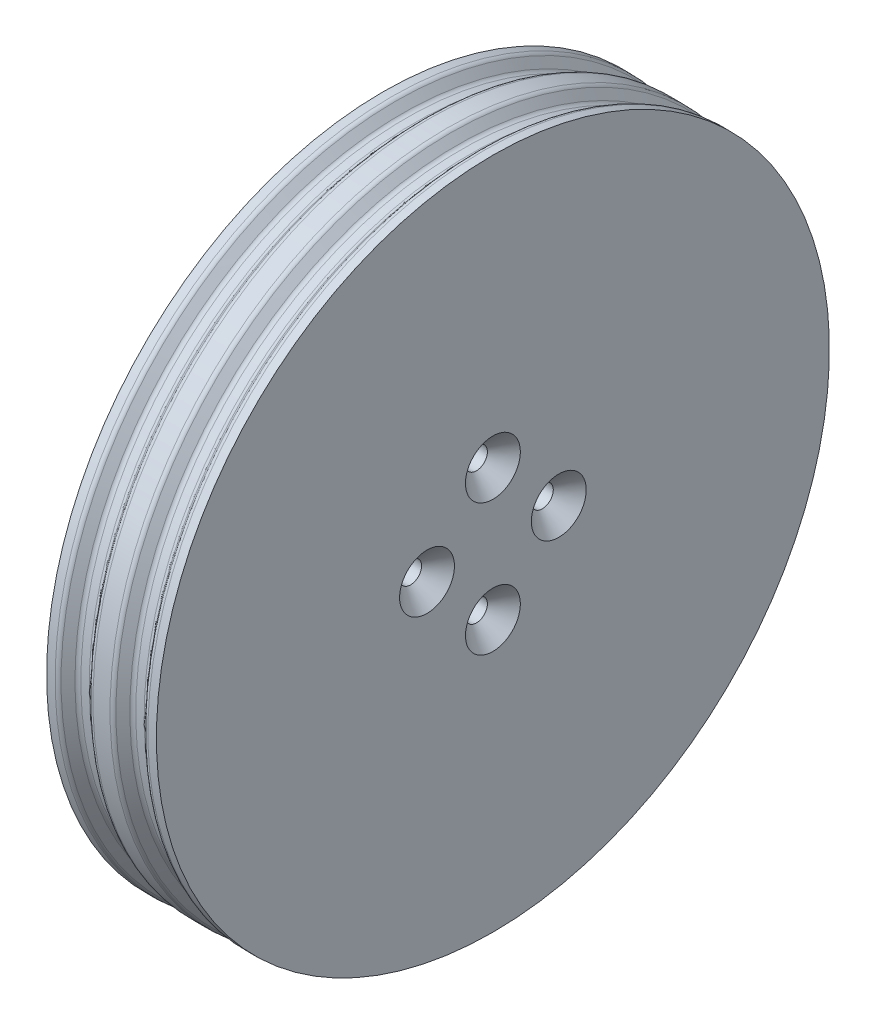
ISO-10303-21;
HEADER;
FILE_DESCRIPTION(('STEP AP214'),'2;1');
FILE_NAME('part.step','',(''),(''),'','','');
FILE_SCHEMA(('AUTOMOTIVE_DESIGN { 1 0 10303 214 1 1 1 1 }'));
ENDSEC;
DATA;
#1=APPLICATION_CONTEXT('core data for automotive mechanical design processes');
#2=APPLICATION_PROTOCOL_DEFINITION('international standard','automotive_design',2000,#1);
#3=PRODUCT_CONTEXT('',#1,'mechanical');
#4=PRODUCT('Part','Part','',(#3));
#5=PRODUCT_RELATED_PRODUCT_CATEGORY('part','',(#4));
#6=PRODUCT_DEFINITION_FORMATION('','',#4);
#7=PRODUCT_DEFINITION_CONTEXT('part definition',#1,'design');
#8=PRODUCT_DEFINITION('design','',#6,#7);
#9=PRODUCT_DEFINITION_SHAPE('','',#8);
#10=(LENGTH_UNIT() NAMED_UNIT(*) SI_UNIT(.MILLI.,.METRE.));
#11=(NAMED_UNIT(*) PLANE_ANGLE_UNIT() SI_UNIT($,.RADIAN.));
#12=(NAMED_UNIT(*) SI_UNIT($,.STERADIAN.) SOLID_ANGLE_UNIT());
#13=UNCERTAINTY_MEASURE_WITH_UNIT(LENGTH_MEASURE(1.E-05),#10,'distance_accuracy_value','');
#14=(GEOMETRIC_REPRESENTATION_CONTEXT(3) GLOBAL_UNCERTAINTY_ASSIGNED_CONTEXT((#13)) GLOBAL_UNIT_ASSIGNED_CONTEXT((#10,
#11,#12)) REPRESENTATION_CONTEXT('',''));
#15=CARTESIAN_POINT('',(0.,0.,0.));
#16=DIRECTION('',(0.,0.,1.));
#17=DIRECTION('',(1.,0.,0.));
#18=AXIS2_PLACEMENT_3D('',#15,#16,#17);
#19=CARTESIAN_POINT('',(0.,0.,0.));
#20=DIRECTION('',(1.,0.,0.));
#21=DIRECTION('',(0.,1.,0.));
#22=AXIS2_PLACEMENT_3D('',#19,#20,#21);
#23=PLANE('',#22);
#24=CARTESIAN_POINT('',(0.,6.,0.));
#25=DIRECTION('',(1.,0.,0.));
#26=DIRECTION('',(0.,1.,0.));
#27=AXIS2_PLACEMENT_3D('',#24,#25,#26);
#28=CIRCLE('',#27,1.);
#29=CARTESIAN_POINT('',(0.,7.,0.));
#30=VERTEX_POINT('',#29);
#31=EDGE_CURVE('E129',#30,#30,#28,.T.);
#32=ORIENTED_EDGE('',*,*,#31,.T.);
#33=EDGE_LOOP('',(#32));
#34=FACE_BOUND('',#33,.T.);
#35=CARTESIAN_POINT('',(0.,0.,-6.));
#36=DIRECTION('',(1.,0.,0.));
#37=DIRECTION('',(0.,1.,0.));
#38=AXIS2_PLACEMENT_3D('',#35,#36,#37);
#39=CIRCLE('',#38,0.999999999999999);
#40=CARTESIAN_POINT('',(0.,1.,-6.));
#41=VERTEX_POINT('',#40);
#42=EDGE_CURVE('E132',#41,#41,#39,.T.);
#43=ORIENTED_EDGE('',*,*,#42,.T.);
#44=EDGE_LOOP('',(#43));
#45=FACE_BOUND('',#44,.T.);
#46=CARTESIAN_POINT('',(0.,-6.,0.));
#47=DIRECTION('',(1.,0.,0.));
#48=DIRECTION('',(0.,1.,0.));
#49=AXIS2_PLACEMENT_3D('',#46,#47,#48);
#50=CIRCLE('',#49,1.);
#51=CARTESIAN_POINT('',(0.,-5.,0.));
#52=VERTEX_POINT('',#51);
#53=EDGE_CURVE('E135',#52,#52,#50,.T.);
#54=ORIENTED_EDGE('',*,*,#53,.T.);
#55=EDGE_LOOP('',(#54));
#56=FACE_BOUND('',#55,.T.);
#57=CARTESIAN_POINT('',(0.,0.,6.));
#58=DIRECTION('',(1.,0.,0.));
#59=DIRECTION('',(0.,1.,0.));
#60=AXIS2_PLACEMENT_3D('',#57,#58,#59);
#61=CIRCLE('',#60,1.);
#62=CARTESIAN_POINT('',(0.,1.,6.));
#63=VERTEX_POINT('',#62);
#64=EDGE_CURVE('E138',#63,#63,#61,.T.);
#65=ORIENTED_EDGE('',*,*,#64,.T.);
#66=EDGE_LOOP('',(#65));
#67=FACE_BOUND('',#66,.T.);
#68=CARTESIAN_POINT('',(0.,0.,0.));
#69=DIRECTION('',(-1.,0.,0.));
#70=DIRECTION('',(0.,-1.,0.));
#71=AXIS2_PLACEMENT_3D('',#68,#69,#70);
#72=CIRCLE('',#71,17.3);
#73=CARTESIAN_POINT('',(0.,-17.3,0.));
#74=VERTEX_POINT('',#73);
#75=EDGE_CURVE('E117',#74,#74,#72,.T.);
#76=ORIENTED_EDGE('',*,*,#75,.T.);
#77=EDGE_LOOP('',(#76));
#78=FACE_BOUND('',#77,.T.);
#79=ADVANCED_FACE('F37',(#34,#45,#56,#67,#78),#23,.F.);
#80=CARTESIAN_POINT('',(0.,0.,0.));
#81=DIRECTION('',(-1.,0.,0.));
#82=DIRECTION('',(0.,-1.,0.));
#83=AXIS2_PLACEMENT_3D('',#80,#81,#82);
#84=CYLINDRICAL_SURFACE('',#83,17.3);
#85=ORIENTED_EDGE('',*,*,#75,.F.);
#86=EDGE_LOOP('',(#85));
#87=FACE_BOUND('',#86,.T.);
#88=CARTESIAN_POINT('',(-7.,0.,0.));
#89=DIRECTION('',(-1.,0.,0.));
#90=DIRECTION('',(0.,-1.,0.));
#91=AXIS2_PLACEMENT_3D('',#88,#89,#90);
#92=CIRCLE('',#91,17.3);
#93=CARTESIAN_POINT('',(-7.,-17.3,0.));
#94=VERTEX_POINT('',#93);
#95=EDGE_CURVE('E120',#94,#94,#92,.T.);
#96=ORIENTED_EDGE('',*,*,#95,.T.);
#97=EDGE_LOOP('',(#96));
#98=FACE_BOUND('',#97,.T.);
#99=ADVANCED_FACE('F161',(#87,#98),#84,.F.);
#100=CARTESIAN_POINT('',(-7.,17.3,0.));
#101=DIRECTION('',(1.,0.,0.));
#102=DIRECTION('',(0.,1.,0.));
#103=AXIS2_PLACEMENT_3D('',#100,#101,#102);
#104=PLANE('',#103);
#105=ORIENTED_EDGE('',*,*,#95,.F.);
#106=EDGE_LOOP('',(#105));
#107=FACE_BOUND('',#106,.T.);
#108=CARTESIAN_POINT('',(-7.,0.,0.));
#109=DIRECTION('',(-1.,0.,0.));
#110=DIRECTION('',(0.,-1.,0.));
#111=AXIS2_PLACEMENT_3D('',#108,#109,#110);
#112=CIRCLE('',#111,30.65);
#113=CARTESIAN_POINT('',(-6.99999999999999,-30.65,0.));
#114=VERTEX_POINT('',#113);
#115=EDGE_CURVE('E123',#114,#114,#112,.T.);
#116=ORIENTED_EDGE('',*,*,#115,.T.);
#117=EDGE_LOOP('',(#116));
#118=FACE_BOUND('',#117,.T.);
#119=ADVANCED_FACE('F167',(#107,#118),#104,.F.);
#120=CARTESIAN_POINT('',(0.,0.,0.));
#121=DIRECTION('',(-1.,0.,0.));
#122=DIRECTION('',(0.,-1.,0.));
#123=AXIS2_PLACEMENT_3D('',#120,#121,#122);
#124=CYLINDRICAL_SURFACE('',#123,30.65);
#125=CARTESIAN_POINT('',(-6.22305298567365,0.,0.));
#126=DIRECTION('',(1.,0.,0.));
#127=DIRECTION('',(0.,1.,0.));
#128=AXIS2_PLACEMENT_3D('',#125,#126,#127);
#129=CIRCLE('',#128,30.65);
#130=CARTESIAN_POINT('',(-6.22305298567366,30.65,0.));
#131=VERTEX_POINT('',#130);
#132=EDGE_CURVE('E10',#131,#131,#129,.F.);
#133=ORIENTED_EDGE('',*,*,#132,.T.);
#134=EDGE_LOOP('',(#133));
#135=FACE_BOUND('',#134,.T.);
#136=ORIENTED_EDGE('',*,*,#115,.F.);
#137=EDGE_LOOP('',(#136));
#138=FACE_BOUND('',#137,.T.);
#139=ADVANCED_FACE('F255',(#135,#138),#124,.T.);
#140=CARTESIAN_POINT('',(-5.10224306131887,0.,0.));
#141=DIRECTION('',(-1.,0.,0.));
#142=DIRECTION('',(0.,-1.,0.));
#143=AXIS2_PLACEMENT_3D('',#140,#141,#142);
#144=CONICAL_SURFACE('',#143,29.65,0.83922186850205);
#145=CARTESIAN_POINT('',(-5.25125183601437,0.,0.));
#146=DIRECTION('',(-1.,0.,0.));
#147=DIRECTION('',(0.,-1.,0.));
#148=AXIS2_PLACEMENT_3D('',#145,#146,#147);
#149=CIRCLE('',#148,29.8159789730107);
#150=CARTESIAN_POINT('',(-5.25125183601437,-29.8159789730107,0.));
#151=VERTEX_POINT('',#150);
#152=EDGE_CURVE('E57',#151,#151,#149,.T.);
#153=ORIENTED_EDGE('',*,*,#152,.T.);
#154=EDGE_LOOP('',(#153));
#155=FACE_BOUND('',#154,.T.);
#156=CARTESIAN_POINT('',(-5.8509912253045,0.,0.));
#157=DIRECTION('',(1.,0.,0.));
#158=DIRECTION('',(0.,1.,0.));
#159=AXIS2_PLACEMENT_3D('',#156,#157,#158);
#160=CIRCLE('',#159,30.4840210269893);
#161=CARTESIAN_POINT('',(-5.85099122530451,30.4840210269893,0.));
#162=VERTEX_POINT('',#161);
#163=EDGE_CURVE('E60',#162,#162,#160,.T.);
#164=ORIENTED_EDGE('',*,*,#163,.T.);
#165=EDGE_LOOP('',(#164));
#166=FACE_BOUND('',#165,.T.);
#167=ADVANCED_FACE('F248',(#155,#166),#144,.T.);
#168=CARTESIAN_POINT('',(0.,0.,0.));
#169=DIRECTION('',(-1.,0.,0.));
#170=DIRECTION('',(0.,-1.,0.));
#171=AXIS2_PLACEMENT_3D('',#168,#169,#170);
#172=CYLINDRICAL_SURFACE('',#171,29.65);
#173=CARTESIAN_POINT('',(-4.12080992435478,0.,0.));
#174=DIRECTION('',(-1.,0.,0.));
#175=DIRECTION('',(0.,-1.,0.));
#176=AXIS2_PLACEMENT_3D('',#173,#174,#175);
#177=CIRCLE('',#176,29.65);
#178=CARTESIAN_POINT('',(-4.12080992435477,-29.65,0.));
#179=VERTEX_POINT('',#178);
#180=EDGE_CURVE('E69',#179,#179,#177,.T.);
#181=ORIENTED_EDGE('',*,*,#180,.T.);
#182=EDGE_LOOP('',(#181));
#183=FACE_BOUND('',#182,.T.);
#184=CARTESIAN_POINT('',(-4.87919007564522,0.,0.));
#185=DIRECTION('',(-1.,0.,0.));
#186=DIRECTION('',(0.,-1.,0.));
#187=AXIS2_PLACEMENT_3D('',#184,#185,#186);
#188=CIRCLE('',#187,29.65);
#189=CARTESIAN_POINT('',(-4.87919007564521,-29.65,0.));
#190=VERTEX_POINT('',#189);
#191=EDGE_CURVE('E72',#190,#190,#188,.F.);
#192=ORIENTED_EDGE('',*,*,#191,.T.);
#193=EDGE_LOOP('',(#192));
#194=FACE_BOUND('',#193,.T.);
#195=ADVANCED_FACE('F239',(#183,#194),#172,.T.);
#196=CARTESIAN_POINT('',(-3.,0.,0.));
#197=DIRECTION('',(1.,0.,0.));
#198=DIRECTION('',(0.,1.,0.));
#199=AXIS2_PLACEMENT_3D('',#196,#197,#198);
#200=CONICAL_SURFACE('',#199,30.65,0.83922186850205);
#201=CARTESIAN_POINT('',(-3.74874816398562,0.,0.));
#202=DIRECTION('',(1.,0.,0.));
#203=DIRECTION('',(0.,1.,0.));
#204=AXIS2_PLACEMENT_3D('',#201,#202,#203);
#205=CIRCLE('',#204,29.8159789730107);
#206=CARTESIAN_POINT('',(-3.74874816398563,29.8159789730107,0.));
#207=VERTEX_POINT('',#206);
#208=EDGE_CURVE('E63',#207,#207,#205,.T.);
#209=ORIENTED_EDGE('',*,*,#208,.T.);
#210=EDGE_LOOP('',(#209));
#211=FACE_BOUND('',#210,.T.);
#212=CARTESIAN_POINT('',(-3.14900877469549,0.,0.));
#213=DIRECTION('',(-1.,0.,0.));
#214=DIRECTION('',(0.,-1.,0.));
#215=AXIS2_PLACEMENT_3D('',#212,#213,#214);
#216=CIRCLE('',#215,30.4840210269893);
#217=CARTESIAN_POINT('',(-3.14900877469549,-30.4840210269893,0.));
#218=VERTEX_POINT('',#217);
#219=EDGE_CURVE('E66',#218,#218,#216,.T.);
#220=ORIENTED_EDGE('',*,*,#219,.T.);
#221=EDGE_LOOP('',(#220));
#222=FACE_BOUND('',#221,.T.);
#223=ADVANCED_FACE('F236',(#211,#222),#200,.T.);
#224=CARTESIAN_POINT('',(0.,0.,0.));
#225=DIRECTION('',(-1.,0.,0.));
#226=DIRECTION('',(0.,-1.,0.));
#227=AXIS2_PLACEMENT_3D('',#224,#225,#226);
#228=CYLINDRICAL_SURFACE('',#227,30.65);
#229=CARTESIAN_POINT('',(-1.22305298567365,0.,0.));
#230=DIRECTION('',(1.,0.,0.));
#231=DIRECTION('',(0.,1.,0.));
#232=AXIS2_PLACEMENT_3D('',#229,#230,#231);
#233=CIRCLE('',#232,30.65);
#234=CARTESIAN_POINT('',(-1.22305298567366,30.65,0.));
#235=VERTEX_POINT('',#234);
#236=EDGE_CURVE('E44',#235,#235,#233,.F.);
#237=ORIENTED_EDGE('',*,*,#236,.T.);
#238=EDGE_LOOP('',(#237));
#239=FACE_BOUND('',#238,.T.);
#240=CARTESIAN_POINT('',(-2.77694701432634,0.,0.));
#241=DIRECTION('',(1.,0.,0.));
#242=DIRECTION('',(0.,1.,0.));
#243=AXIS2_PLACEMENT_3D('',#240,#241,#242);
#244=CIRCLE('',#243,30.65);
#245=CARTESIAN_POINT('',(-2.77694701432635,30.65,0.));
#246=VERTEX_POINT('',#245);
#247=EDGE_CURVE('E48',#246,#246,#244,.T.);
#248=ORIENTED_EDGE('',*,*,#247,.T.);
#249=EDGE_LOOP('',(#248));
#250=FACE_BOUND('',#249,.T.);
#251=ADVANCED_FACE('F238',(#239,#250),#228,.T.);
#252=CARTESIAN_POINT('',(-0.102243061318873,0.,0.));
#253=DIRECTION('',(-1.,0.,0.));
#254=DIRECTION('',(0.,-1.,0.));
#255=AXIS2_PLACEMENT_3D('',#252,#253,#254);
#256=CONICAL_SURFACE('',#255,29.65,0.839221868502049);
#257=CARTESIAN_POINT('',(-0.25125183601437,0.,0.));
#258=DIRECTION('',(-1.,0.,0.));
#259=DIRECTION('',(0.,-1.,0.));
#260=AXIS2_PLACEMENT_3D('',#257,#258,#259);
#261=CIRCLE('',#260,29.8159789730107);
#262=CARTESIAN_POINT('',(-0.251251836014364,-29.8159789730107,0.));
#263=VERTEX_POINT('',#262);
#264=EDGE_CURVE('E75',#263,#263,#261,.T.);
#265=ORIENTED_EDGE('',*,*,#264,.T.);
#266=EDGE_LOOP('',(#265));
#267=FACE_BOUND('',#266,.T.);
#268=CARTESIAN_POINT('',(-0.850991225304496,0.,0.));
#269=DIRECTION('',(1.,0.,0.));
#270=DIRECTION('',(0.,1.,0.));
#271=AXIS2_PLACEMENT_3D('',#268,#269,#270);
#272=CIRCLE('',#271,30.4840210269893);
#273=CARTESIAN_POINT('',(-0.850991225304502,30.4840210269893,0.));
#274=VERTEX_POINT('',#273);
#275=EDGE_CURVE('E78',#274,#274,#272,.T.);
#276=ORIENTED_EDGE('',*,*,#275,.T.);
#277=EDGE_LOOP('',(#276));
#278=FACE_BOUND('',#277,.T.);
#279=ADVANCED_FACE('F246',(#267,#278),#256,.T.);
#280=CARTESIAN_POINT('',(0.,0.,0.));
#281=DIRECTION('',(-1.,0.,0.));
#282=DIRECTION('',(0.,-1.,0.));
#283=AXIS2_PLACEMENT_3D('',#280,#281,#282);
#284=CYLINDRICAL_SURFACE('',#283,29.65);
#285=CARTESIAN_POINT('',(0.87919007564522,0.,0.));
#286=DIRECTION('',(-1.,0.,0.));
#287=DIRECTION('',(0.,-1.,0.));
#288=AXIS2_PLACEMENT_3D('',#285,#286,#287);
#289=CIRCLE('',#288,29.65);
#290=CARTESIAN_POINT('',(0.879190075645226,-29.65,0.));
#291=VERTEX_POINT('',#290);
#292=EDGE_CURVE('E87',#291,#291,#289,.T.);
#293=ORIENTED_EDGE('',*,*,#292,.T.);
#294=EDGE_LOOP('',(#293));
#295=FACE_BOUND('',#294,.T.);
#296=CARTESIAN_POINT('',(0.120809924354782,0.,0.));
#297=DIRECTION('',(-1.,0.,0.));
#298=DIRECTION('',(0.,-1.,0.));
#299=AXIS2_PLACEMENT_3D('',#296,#297,#298);
#300=CIRCLE('',#299,29.65);
#301=CARTESIAN_POINT('',(0.120809924354788,-29.65,0.));
#302=VERTEX_POINT('',#301);
#303=EDGE_CURVE('E90',#302,#302,#300,.F.);
#304=ORIENTED_EDGE('',*,*,#303,.T.);
#305=EDGE_LOOP('',(#304));
#306=FACE_BOUND('',#305,.T.);
#307=ADVANCED_FACE('F304',(#295,#306),#284,.T.);
#308=CARTESIAN_POINT('',(2.,0.,0.));
#309=DIRECTION('',(1.,0.,0.));
#310=DIRECTION('',(0.,1.,0.));
#311=AXIS2_PLACEMENT_3D('',#308,#309,#310);
#312=CONICAL_SURFACE('',#311,30.65,0.83922186850205);
#313=CARTESIAN_POINT('',(1.25125183601437,0.,0.));
#314=DIRECTION('',(1.,0.,0.));
#315=DIRECTION('',(0.,1.,0.));
#316=AXIS2_PLACEMENT_3D('',#313,#314,#315);
#317=CIRCLE('',#316,29.8159789730107);
#318=CARTESIAN_POINT('',(1.25125183601436,29.8159789730107,0.));
#319=VERTEX_POINT('',#318);
#320=EDGE_CURVE('E81',#319,#319,#317,.T.);
#321=ORIENTED_EDGE('',*,*,#320,.T.);
#322=EDGE_LOOP('',(#321));
#323=FACE_BOUND('',#322,.T.);
#324=CARTESIAN_POINT('',(1.8509912253045,0.,0.));
#325=DIRECTION('',(-1.,0.,0.));
#326=DIRECTION('',(0.,-1.,0.));
#327=AXIS2_PLACEMENT_3D('',#324,#325,#326);
#328=CIRCLE('',#327,30.4840210269893);
#329=CARTESIAN_POINT('',(1.85099122530451,-30.4840210269893,0.));
#330=VERTEX_POINT('',#329);
#331=EDGE_CURVE('E84',#330,#330,#328,.T.);
#332=ORIENTED_EDGE('',*,*,#331,.T.);
#333=EDGE_LOOP('',(#332));
#334=FACE_BOUND('',#333,.T.);
#335=ADVANCED_FACE('F314',(#323,#334),#312,.T.);
#336=CARTESIAN_POINT('',(0.,0.,0.));
#337=DIRECTION('',(-1.,0.,0.));
#338=DIRECTION('',(0.,-1.,0.));
#339=AXIS2_PLACEMENT_3D('',#336,#337,#338);
#340=CYLINDRICAL_SURFACE('',#339,30.65);
#341=CARTESIAN_POINT('',(2.22305298567365,0.,0.));
#342=DIRECTION('',(1.,0.,0.));
#343=DIRECTION('',(0.,1.,0.));
#344=AXIS2_PLACEMENT_3D('',#341,#342,#343);
#345=CIRCLE('',#344,30.65);
#346=CARTESIAN_POINT('',(2.22305298567365,30.65,0.));
#347=VERTEX_POINT('',#346);
#348=EDGE_CURVE('E52',#347,#347,#345,.T.);
#349=ORIENTED_EDGE('',*,*,#348,.T.);
#350=EDGE_LOOP('',(#349));
#351=FACE_BOUND('',#350,.T.);
#352=CARTESIAN_POINT('',(3.,0.,0.));
#353=DIRECTION('',(-1.,0.,0.));
#354=DIRECTION('',(0.,-1.,0.));
#355=AXIS2_PLACEMENT_3D('',#352,#353,#354);
#356=CIRCLE('',#355,30.65);
#357=CARTESIAN_POINT('',(3.00000000000001,-30.65,0.));
#358=VERTEX_POINT('',#357);
#359=EDGE_CURVE('E126',#358,#358,#356,.T.);
#360=ORIENTED_EDGE('',*,*,#359,.T.);
#361=EDGE_LOOP('',(#360));
#362=FACE_BOUND('',#361,.T.);
#363=ADVANCED_FACE('F157',(#351,#362),#340,.T.);
#364=CARTESIAN_POINT('',(2.99999999999999,30.65,0.));
#365=DIRECTION('',(-1.,0.,0.));
#366=DIRECTION('',(0.,-1.,0.));
#367=AXIS2_PLACEMENT_3D('',#364,#365,#366);
#368=PLANE('',#367);
#369=CARTESIAN_POINT('',(3.,0.,-6.));
#370=DIRECTION('',(-1.,0.,0.));
#371=DIRECTION('',(0.,-1.,0.));
#372=AXIS2_PLACEMENT_3D('',#369,#370,#371);
#373=CIRCLE('',#372,2.50000000000004);
#374=CARTESIAN_POINT('',(3.,-2.50000000000004,-6.));
#375=VERTEX_POINT('',#374);
#376=EDGE_CURVE('E102',#375,#375,#373,.T.);
#377=ORIENTED_EDGE('',*,*,#376,.T.);
#378=EDGE_LOOP('',(#377));
#379=FACE_BOUND('',#378,.T.);
#380=CARTESIAN_POINT('',(3.,-6.,0.));
#381=DIRECTION('',(-1.,0.,0.));
#382=DIRECTION('',(0.,-1.,0.));
#383=AXIS2_PLACEMENT_3D('',#380,#381,#382);
#384=CIRCLE('',#383,2.50000000000004);
#385=CARTESIAN_POINT('',(3.,-8.50000000000004,0.));
#386=VERTEX_POINT('',#385);
#387=EDGE_CURVE('E105',#386,#386,#384,.T.);
#388=ORIENTED_EDGE('',*,*,#387,.T.);
#389=EDGE_LOOP('',(#388));
#390=FACE_BOUND('',#389,.T.);
#391=CARTESIAN_POINT('',(3.,0.,6.));
#392=DIRECTION('',(-1.,0.,0.));
#393=DIRECTION('',(0.,-1.,0.));
#394=AXIS2_PLACEMENT_3D('',#391,#392,#393);
#395=CIRCLE('',#394,2.50000000000004);
#396=CARTESIAN_POINT('',(3.,-2.50000000000004,6.));
#397=VERTEX_POINT('',#396);
#398=EDGE_CURVE('E108',#397,#397,#395,.T.);
#399=ORIENTED_EDGE('',*,*,#398,.T.);
#400=EDGE_LOOP('',(#399));
#401=FACE_BOUND('',#400,.T.);
#402=CARTESIAN_POINT('',(3.,6.,0.));
#403=DIRECTION('',(-1.,0.,0.));
#404=DIRECTION('',(0.,-1.,0.));
#405=AXIS2_PLACEMENT_3D('',#402,#403,#404);
#406=CIRCLE('',#405,2.50000000000001);
#407=CARTESIAN_POINT('',(3.,3.49999999999999,0.));
#408=VERTEX_POINT('',#407);
#409=EDGE_CURVE('E111',#408,#408,#406,.T.);
#410=ORIENTED_EDGE('',*,*,#409,.T.);
#411=EDGE_LOOP('',(#410));
#412=FACE_BOUND('',#411,.T.);
#413=ORIENTED_EDGE('',*,*,#359,.F.);
#414=EDGE_LOOP('',(#413));
#415=FACE_BOUND('',#414,.T.);
#416=ADVANCED_FACE('F147',(#379,#390,#401,#412,#415),#368,.F.);
#417=CARTESIAN_POINT('',(-7.,0.,6.));
#418=DIRECTION('',(1.,0.,0.));
#419=DIRECTION('',(0.,1.,0.));
#420=AXIS2_PLACEMENT_3D('',#417,#418,#419);
#421=CYLINDRICAL_SURFACE('',#420,1.);
#422=CARTESIAN_POINT('',(1.49999999999997,0.,6.));
#423=DIRECTION('',(-1.,0.,0.));
#424=DIRECTION('',(0.,-1.,0.));
#425=AXIS2_PLACEMENT_3D('',#422,#423,#424);
#426=CIRCLE('',#425,1.);
#427=CARTESIAN_POINT('',(1.49999999999997,-0.999999999999999,6.));
#428=VERTEX_POINT('',#427);
#429=EDGE_CURVE('E96',#428,#428,#426,.F.);
#430=ORIENTED_EDGE('',*,*,#429,.T.);
#431=EDGE_LOOP('',(#430));
#432=FACE_BOUND('',#431,.T.);
#433=ORIENTED_EDGE('',*,*,#64,.F.);
#434=EDGE_LOOP('',(#433));
#435=FACE_BOUND('',#434,.T.);
#436=ADVANCED_FACE('F144',(#432,#435),#421,.F.);
#437=CARTESIAN_POINT('',(-7.,-6.,0.));
#438=DIRECTION('',(1.,0.,0.));
#439=DIRECTION('',(0.,1.,0.));
#440=AXIS2_PLACEMENT_3D('',#437,#438,#439);
#441=CYLINDRICAL_SURFACE('',#440,1.);
#442=CARTESIAN_POINT('',(1.49999999999997,-6.,0.));
#443=DIRECTION('',(-1.,0.,0.));
#444=DIRECTION('',(0.,0.,1.));
#445=AXIS2_PLACEMENT_3D('',#442,#443,#444);
#446=CIRCLE('',#445,1.);
#447=CARTESIAN_POINT('',(1.49999999999997,-6.,1.));
#448=VERTEX_POINT('',#447);
#449=EDGE_CURVE('E99',#448,#448,#446,.F.);
#450=ORIENTED_EDGE('',*,*,#449,.T.);
#451=EDGE_LOOP('',(#450));
#452=FACE_BOUND('',#451,.T.);
#453=ORIENTED_EDGE('',*,*,#53,.F.);
#454=EDGE_LOOP('',(#453));
#455=FACE_BOUND('',#454,.T.);
#456=ADVANCED_FACE('F146',(#452,#455),#441,.F.);
#457=CARTESIAN_POINT('',(-7.,0.,-6.));
#458=DIRECTION('',(1.,0.,0.));
#459=DIRECTION('',(0.,1.,0.));
#460=AXIS2_PLACEMENT_3D('',#457,#458,#459);
#461=CYLINDRICAL_SURFACE('',#460,0.999999999999999);
#462=CARTESIAN_POINT('',(1.49999999999996,0.,-6.));
#463=DIRECTION('',(-1.,0.,0.));
#464=DIRECTION('',(0.,-1.,0.));
#465=AXIS2_PLACEMENT_3D('',#462,#463,#464);
#466=CIRCLE('',#465,0.999999999999999);
#467=CARTESIAN_POINT('',(1.49999999999996,-0.999999999999998,-6.));
#468=VERTEX_POINT('',#467);
#469=EDGE_CURVE('E114',#468,#468,#466,.F.);
#470=ORIENTED_EDGE('',*,*,#469,.T.);
#471=EDGE_LOOP('',(#470));
#472=FACE_BOUND('',#471,.T.);
#473=ORIENTED_EDGE('',*,*,#42,.F.);
#474=EDGE_LOOP('',(#473));
#475=FACE_BOUND('',#474,.T.);
#476=ADVANCED_FACE('F154',(#472,#475),#461,.F.);
#477=CARTESIAN_POINT('',(-7.,6.,0.));
#478=DIRECTION('',(1.,0.,0.));
#479=DIRECTION('',(0.,1.,0.));
#480=AXIS2_PLACEMENT_3D('',#477,#478,#479);
#481=CYLINDRICAL_SURFACE('',#480,1.);
#482=CARTESIAN_POINT('',(1.49999999999999,6.,0.));
#483=DIRECTION('',(-1.,0.,0.));
#484=DIRECTION('',(0.,0.,1.));
#485=AXIS2_PLACEMENT_3D('',#482,#483,#484);
#486=CIRCLE('',#485,1.);
#487=CARTESIAN_POINT('',(1.49999999999999,6.,1.));
#488=VERTEX_POINT('',#487);
#489=EDGE_CURVE('E93',#488,#488,#486,.F.);
#490=ORIENTED_EDGE('',*,*,#489,.T.);
#491=EDGE_LOOP('',(#490));
#492=FACE_BOUND('',#491,.T.);
#493=ORIENTED_EDGE('',*,*,#31,.F.);
#494=EDGE_LOOP('',(#493));
#495=FACE_BOUND('',#494,.T.);
#496=ADVANCED_FACE('F181',(#492,#495),#481,.F.);
#497=CARTESIAN_POINT('',(1.49999999999996,0.,-6.));
#498=DIRECTION('',(1.,0.,0.));
#499=DIRECTION('',(0.,1.,0.));
#500=AXIS2_PLACEMENT_3D('',#497,#498,#499);
#501=CONICAL_SURFACE('',#500,0.999999999999999,0.785398163397451);
#502=ORIENTED_EDGE('',*,*,#376,.F.);
#503=EDGE_LOOP('',(#502));
#504=FACE_BOUND('',#503,.T.);
#505=ORIENTED_EDGE('',*,*,#469,.F.);
#506=EDGE_LOOP('',(#505));
#507=FACE_BOUND('',#506,.T.);
#508=ADVANCED_FACE('F174',(#504,#507),#501,.F.);
#509=CARTESIAN_POINT('',(1.49999999999997,-6.,0.));
#510=DIRECTION('',(1.,0.,0.));
#511=DIRECTION('',(0.,0.,-1.));
#512=AXIS2_PLACEMENT_3D('',#509,#510,#511);
#513=CONICAL_SURFACE('',#512,1.,0.785398163397451);
#514=ORIENTED_EDGE('',*,*,#387,.F.);
#515=EDGE_LOOP('',(#514));
#516=FACE_BOUND('',#515,.T.);
#517=ORIENTED_EDGE('',*,*,#449,.F.);
#518=EDGE_LOOP('',(#517));
#519=FACE_BOUND('',#518,.T.);
#520=ADVANCED_FACE('F180',(#516,#519),#513,.F.);
#521=CARTESIAN_POINT('',(1.49999999999997,0.,6.));
#522=DIRECTION('',(1.,0.,0.));
#523=DIRECTION('',(0.,1.,0.));
#524=AXIS2_PLACEMENT_3D('',#521,#522,#523);
#525=CONICAL_SURFACE('',#524,1.,0.785398163397451);
#526=ORIENTED_EDGE('',*,*,#398,.F.);
#527=EDGE_LOOP('',(#526));
#528=FACE_BOUND('',#527,.T.);
#529=ORIENTED_EDGE('',*,*,#429,.F.);
#530=EDGE_LOOP('',(#529));
#531=FACE_BOUND('',#530,.T.);
#532=ADVANCED_FACE('F188',(#528,#531),#525,.F.);
#533=CARTESIAN_POINT('',(1.49999999999999,6.,0.));
#534=DIRECTION('',(1.,0.,0.));
#535=DIRECTION('',(0.,0.,-1.));
#536=AXIS2_PLACEMENT_3D('',#533,#534,#535);
#537=CONICAL_SURFACE('',#536,1.,0.785398163397451);
#538=ORIENTED_EDGE('',*,*,#409,.F.);
#539=EDGE_LOOP('',(#538));
#540=FACE_BOUND('',#539,.T.);
#541=ORIENTED_EDGE('',*,*,#489,.F.);
#542=EDGE_LOOP('',(#541));
#543=FACE_BOUND('',#542,.T.);
#544=ADVANCED_FACE('F195',(#540,#543),#537,.F.);
#545=CARTESIAN_POINT('',(0.87919007564522,0.,0.));
#546=DIRECTION('',(-1.,0.,0.));
#547=DIRECTION('',(0.,-1.,0.));
#548=AXIS2_PLACEMENT_3D('',#545,#546,#547);
#549=TOROIDAL_SURFACE('',#548,30.15,0.5);
#550=ORIENTED_EDGE('',*,*,#320,.F.);
#551=EDGE_LOOP('',(#550));
#552=FACE_BOUND('',#551,.T.);
#553=ORIENTED_EDGE('',*,*,#292,.F.);
#554=EDGE_LOOP('',(#553));
#555=FACE_BOUND('',#554,.T.);
#556=ADVANCED_FACE('F201',(#552,#555),#549,.F.);
#557=CARTESIAN_POINT('',(0.120809924354782,0.,0.));
#558=DIRECTION('',(-1.,0.,0.));
#559=DIRECTION('',(0.,-1.,0.));
#560=AXIS2_PLACEMENT_3D('',#557,#558,#559);
#561=TOROIDAL_SURFACE('',#560,30.15,0.5);
#562=ORIENTED_EDGE('',*,*,#303,.F.);
#563=EDGE_LOOP('',(#562));
#564=FACE_BOUND('',#563,.T.);
#565=ORIENTED_EDGE('',*,*,#264,.F.);
#566=EDGE_LOOP('',(#565));
#567=FACE_BOUND('',#566,.T.);
#568=ADVANCED_FACE('F205',(#564,#567),#561,.F.);
#569=CARTESIAN_POINT('',(-4.12080992435478,0.,0.));
#570=DIRECTION('',(-1.,0.,0.));
#571=DIRECTION('',(0.,-1.,0.));
#572=AXIS2_PLACEMENT_3D('',#569,#570,#571);
#573=TOROIDAL_SURFACE('',#572,30.15,0.5);
#574=ORIENTED_EDGE('',*,*,#208,.F.);
#575=EDGE_LOOP('',(#574));
#576=FACE_BOUND('',#575,.T.);
#577=ORIENTED_EDGE('',*,*,#180,.F.);
#578=EDGE_LOOP('',(#577));
#579=FACE_BOUND('',#578,.T.);
#580=ADVANCED_FACE('F209',(#576,#579),#573,.F.);
#581=CARTESIAN_POINT('',(-4.87919007564522,0.,0.));
#582=DIRECTION('',(-1.,0.,0.));
#583=DIRECTION('',(0.,-1.,0.));
#584=AXIS2_PLACEMENT_3D('',#581,#582,#583);
#585=TOROIDAL_SURFACE('',#584,30.15,0.5);
#586=ORIENTED_EDGE('',*,*,#191,.F.);
#587=EDGE_LOOP('',(#586));
#588=FACE_BOUND('',#587,.T.);
#589=ORIENTED_EDGE('',*,*,#152,.F.);
#590=EDGE_LOOP('',(#589));
#591=FACE_BOUND('',#590,.T.);
#592=ADVANCED_FACE('F213',(#588,#591),#585,.F.);
#593=CARTESIAN_POINT('',(2.22305298567365,0.,0.));
#594=DIRECTION('',(1.,0.,0.));
#595=DIRECTION('',(0.,1.,0.));
#596=AXIS2_PLACEMENT_3D('',#593,#594,#595);
#597=TOROIDAL_SURFACE('',#596,30.15,0.5);
#598=ORIENTED_EDGE('',*,*,#348,.F.);
#599=EDGE_LOOP('',(#598));
#600=FACE_BOUND('',#599,.T.);
#601=ORIENTED_EDGE('',*,*,#331,.F.);
#602=EDGE_LOOP('',(#601));
#603=FACE_BOUND('',#602,.T.);
#604=ADVANCED_FACE('F217',(#600,#603),#597,.T.);
#605=CARTESIAN_POINT('',(-1.22305298567365,0.,0.));
#606=DIRECTION('',(1.,0.,0.));
#607=DIRECTION('',(0.,1.,0.));
#608=AXIS2_PLACEMENT_3D('',#605,#606,#607);
#609=TOROIDAL_SURFACE('',#608,30.15,0.5);
#610=ORIENTED_EDGE('',*,*,#275,.F.);
#611=EDGE_LOOP('',(#610));
#612=FACE_BOUND('',#611,.T.);
#613=ORIENTED_EDGE('',*,*,#236,.F.);
#614=EDGE_LOOP('',(#613));
#615=FACE_BOUND('',#614,.T.);
#616=ADVANCED_FACE('F221',(#612,#615),#609,.T.);
#617=CARTESIAN_POINT('',(-2.77694701432634,0.,0.));
#618=DIRECTION('',(1.,0.,0.));
#619=DIRECTION('',(0.,1.,0.));
#620=AXIS2_PLACEMENT_3D('',#617,#618,#619);
#621=TOROIDAL_SURFACE('',#620,30.15,0.5);
#622=ORIENTED_EDGE('',*,*,#247,.F.);
#623=EDGE_LOOP('',(#622));
#624=FACE_BOUND('',#623,.T.);
#625=ORIENTED_EDGE('',*,*,#219,.F.);
#626=EDGE_LOOP('',(#625));
#627=FACE_BOUND('',#626,.T.);
#628=ADVANCED_FACE('F224',(#624,#627),#621,.T.);
#629=CARTESIAN_POINT('',(-6.22305298567365,0.,0.));
#630=DIRECTION('',(1.,0.,0.));
#631=DIRECTION('',(0.,1.,0.));
#632=AXIS2_PLACEMENT_3D('',#629,#630,#631);
#633=TOROIDAL_SURFACE('',#632,30.15,0.5);
#634=ORIENTED_EDGE('',*,*,#163,.F.);
#635=EDGE_LOOP('',(#634));
#636=FACE_BOUND('',#635,.T.);
#637=ORIENTED_EDGE('',*,*,#132,.F.);
#638=EDGE_LOOP('',(#637));
#639=FACE_BOUND('',#638,.T.);
#640=ADVANCED_FACE('F39',(#636,#639),#633,.T.);
#641=CLOSED_SHELL('',(#79,#99,#119,#139,#167,#195,#223,#251,#279,#307,#335,#363,#416,#436,#456,
#476,#496,#508,#520,#532,#544,#556,#568,#580,#592,#604,#616,#628,#640));
#642=MANIFOLD_SOLID_BREP('B2',#641);
#643=ADVANCED_BREP_SHAPE_REPRESENTATION('',(#18,#642),#14);
#644=SHAPE_DEFINITION_REPRESENTATION(#9,#643);
ENDSEC;
END-ISO-10303-21;
